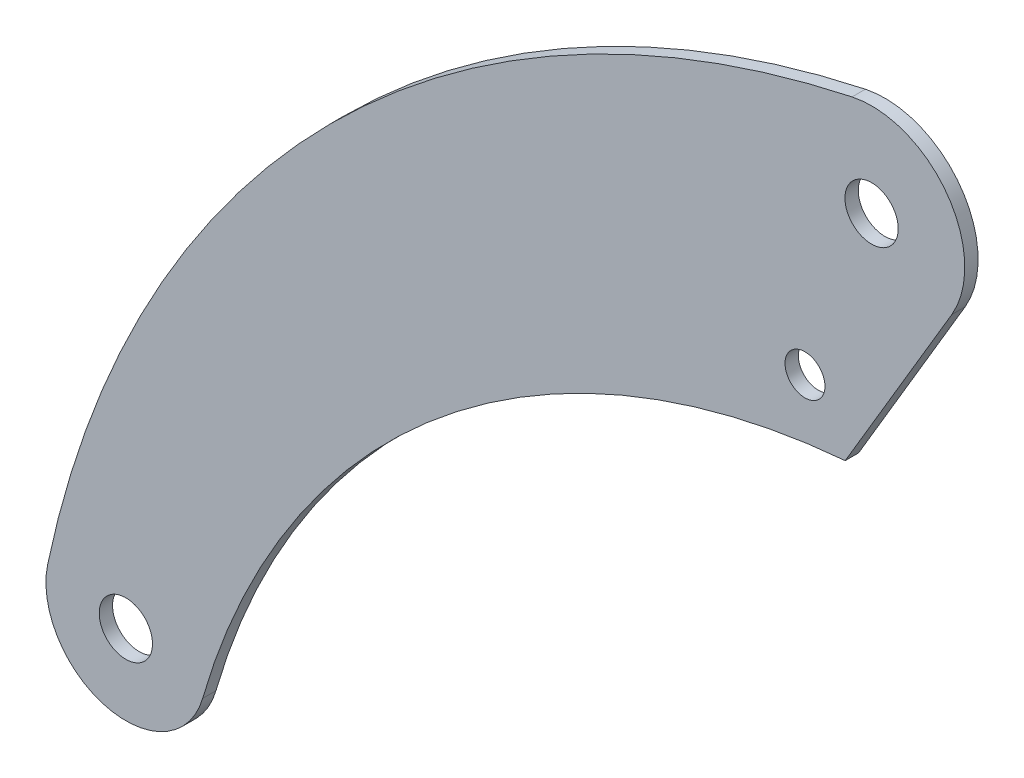
ISO-10303-21;
HEADER;
FILE_DESCRIPTION(('STEP AP214'),'2;1');
FILE_NAME('part.step','',(''),(''),'','','');
FILE_SCHEMA(('AUTOMOTIVE_DESIGN { 1 0 10303 214 1 1 1 1 }'));
ENDSEC;
DATA;
#1=APPLICATION_CONTEXT('core data for automotive mechanical design processes');
#2=APPLICATION_PROTOCOL_DEFINITION('international standard','automotive_design',2000,#1);
#3=PRODUCT_CONTEXT('',#1,'mechanical');
#4=PRODUCT('Part','Part','',(#3));
#5=PRODUCT_RELATED_PRODUCT_CATEGORY('part','',(#4));
#6=PRODUCT_DEFINITION_FORMATION('','',#4);
#7=PRODUCT_DEFINITION_CONTEXT('part definition',#1,'design');
#8=PRODUCT_DEFINITION('design','',#6,#7);
#9=PRODUCT_DEFINITION_SHAPE('','',#8);
#10=(LENGTH_UNIT() NAMED_UNIT(*) SI_UNIT(.MILLI.,.METRE.));
#11=(NAMED_UNIT(*) PLANE_ANGLE_UNIT() SI_UNIT($,.RADIAN.));
#12=(NAMED_UNIT(*) SI_UNIT($,.STERADIAN.) SOLID_ANGLE_UNIT());
#13=UNCERTAINTY_MEASURE_WITH_UNIT(LENGTH_MEASURE(1.E-05),#10,'distance_accuracy_value','');
#14=(GEOMETRIC_REPRESENTATION_CONTEXT(3) GLOBAL_UNCERTAINTY_ASSIGNED_CONTEXT((#13)) GLOBAL_UNIT_ASSIGNED_CONTEXT((#10,
#11,#12)) REPRESENTATION_CONTEXT('',''));
#15=CARTESIAN_POINT('',(0.,0.,0.));
#16=DIRECTION('',(0.,0.,1.));
#17=DIRECTION('',(1.,0.,0.));
#18=AXIS2_PLACEMENT_3D('',#15,#16,#17);
#19=CARTESIAN_POINT('',(149.481823007681,-699.199674335093,5.));
#20=DIRECTION('',(0.,0.,-1.));
#21=DIRECTION('',(-1.,0.,0.));
#22=AXIS2_PLACEMENT_3D('',#19,#20,#21);
#23=PLANE('',#22);
#24=CARTESIAN_POINT('',(149.481823007681,-699.199674335093,5.));
#25=DIRECTION('',(0.,0.,1.));
#26=DIRECTION('',(-1.,0.,0.));
#27=AXIS2_PLACEMENT_3D('',#24,#25,#26);
#28=CIRCLE('',#27,785.);
#29=CARTESIAN_POINT('',(-14.6345840706821,68.4531149698693,5.));
#30=VERTEX_POINT('',#29);
#31=CARTESIAN_POINT('',(-618.715737076498,-537.652440744682,5.));
#32=VERTEX_POINT('',#31);
#33=EDGE_CURVE('E133',#30,#32,#28,.T.);
#34=ORIENTED_EDGE('',*,*,#33,.T.);
#35=CARTESIAN_POINT('',(-560.,-550.,5.));
#36=DIRECTION('',(0.,0.,1.));
#37=DIRECTION('',(1.,0.,0.));
#38=AXIS2_PLACEMENT_3D('',#35,#36,#37);
#39=CIRCLE('',#38,60.);
#40=CARTESIAN_POINT('',(-502.341900982989,-566.599506551236,5.));
#41=VERTEX_POINT('',#40);
#42=EDGE_CURVE('E91',#32,#41,#39,.T.);
#43=ORIENTED_EDGE('',*,*,#42,.T.);
#44=CARTESIAN_POINT('',(26.1906733396146,-718.761649937565,5.));
#45=DIRECTION('',(0.,0.,-1.));
#46=DIRECTION('',(1.,0.,0.));
#47=AXIS2_PLACEMENT_3D('',#44,#45,#46);
#48=CIRCLE('',#47,550.);
#49=CARTESIAN_POINT('',(-19.7795926456078,-170.686167321121,5.));
#50=VERTEX_POINT('',#49);
#51=EDGE_CURVE('E95',#41,#50,#48,.T.);
#52=ORIENTED_EDGE('',*,*,#51,.T.);
#53=DIRECTION('',(0.509802390301733,0.860291533634175,0.));
#54=VECTOR('',#53,1.);
#55=CARTESIAN_POINT('',(60.2204073543922,-35.6861673211213,5.));
#56=LINE('',#55,#54);
#57=CARTESIAN_POINT('',(60.2204073543922,-35.6861673211213,5.));
#58=VERTEX_POINT('',#57);
#59=EDGE_CURVE('E99',#50,#58,#56,.T.);
#60=ORIENTED_EDGE('',*,*,#59,.T.);
#61=CARTESIAN_POINT('',(0.,0.,5.));
#62=DIRECTION('',(0.,0.,1.));
#63=DIRECTION('',(-1.,0.,0.));
#64=AXIS2_PLACEMENT_3D('',#61,#62,#63);
#65=CIRCLE('',#64,70.0000000000001);
#66=EDGE_CURVE('E57',#58,#30,#65,.T.);
#67=ORIENTED_EDGE('',*,*,#66,.T.);
#68=EDGE_LOOP('',(#34,#43,#52,#60,#67));
#69=FACE_BOUND('',#68,.T.);
#70=CARTESIAN_POINT('',(0.,0.,5.));
#71=DIRECTION('',(0.,0.,1.));
#72=DIRECTION('',(1.,0.,0.));
#73=AXIS2_PLACEMENT_3D('',#70,#71,#72);
#74=CIRCLE('',#73,20.);
#75=CARTESIAN_POINT('',(20.,0.,5.));
#76=VERTEX_POINT('',#75);
#77=EDGE_CURVE('E124',#76,#76,#74,.T.);
#78=ORIENTED_EDGE('',*,*,#77,.F.);
#79=EDGE_LOOP('',(#78));
#80=FACE_BOUND('',#79,.T.);
#81=CARTESIAN_POINT('',(-50.,-130.,5.));
#82=DIRECTION('',(0.,0.,1.));
#83=DIRECTION('',(1.,0.,0.));
#84=AXIS2_PLACEMENT_3D('',#81,#82,#83);
#85=CIRCLE('',#84,15.);
#86=CARTESIAN_POINT('',(-35.,-130.,5.));
#87=VERTEX_POINT('',#86);
#88=EDGE_CURVE('E187',#87,#87,#85,.T.);
#89=ORIENTED_EDGE('',*,*,#88,.F.);
#90=EDGE_LOOP('',(#89));
#91=FACE_BOUND('',#90,.T.);
#92=CARTESIAN_POINT('',(-560.,-550.,5.));
#93=DIRECTION('',(0.,0.,1.));
#94=DIRECTION('',(1.,0.,0.));
#95=AXIS2_PLACEMENT_3D('',#92,#93,#94);
#96=CIRCLE('',#95,20.0000000000001);
#97=CARTESIAN_POINT('',(-540.,-550.,5.));
#98=VERTEX_POINT('',#97);
#99=EDGE_CURVE('E176',#98,#98,#96,.T.);
#100=ORIENTED_EDGE('',*,*,#99,.F.);
#101=EDGE_LOOP('',(#100));
#102=FACE_BOUND('',#101,.T.);
#103=ADVANCED_FACE('F39',(#69,#80,#91,#102),#23,.F.);
#104=CARTESIAN_POINT('',(149.481823007681,-699.199674335093,-5.));
#105=DIRECTION('',(0.,0.,-1.));
#106=DIRECTION('',(-1.,0.,0.));
#107=AXIS2_PLACEMENT_3D('',#104,#105,#106);
#108=PLANE('',#107);
#109=CARTESIAN_POINT('',(-50.,-130.,-5.));
#110=DIRECTION('',(0.,0.,1.));
#111=DIRECTION('',(1.,0.,0.));
#112=AXIS2_PLACEMENT_3D('',#109,#110,#111);
#113=CIRCLE('',#112,15.);
#114=CARTESIAN_POINT('',(-35.,-130.,-5.));
#115=VERTEX_POINT('',#114);
#116=EDGE_CURVE('E184',#115,#115,#113,.T.);
#117=ORIENTED_EDGE('',*,*,#116,.T.);
#118=EDGE_LOOP('',(#117));
#119=FACE_BOUND('',#118,.T.);
#120=CARTESIAN_POINT('',(149.481823007681,-699.199674335093,-5.));
#121=DIRECTION('',(0.,0.,1.));
#122=DIRECTION('',(-1.,0.,0.));
#123=AXIS2_PLACEMENT_3D('',#120,#121,#122);
#124=CIRCLE('',#123,785.);
#125=CARTESIAN_POINT('',(-14.6345840706821,68.4531149698693,-5.));
#126=VERTEX_POINT('',#125);
#127=CARTESIAN_POINT('',(-618.715737076498,-537.652440744682,-5.));
#128=VERTEX_POINT('',#127);
#129=EDGE_CURVE('E119',#126,#128,#124,.T.);
#130=ORIENTED_EDGE('',*,*,#129,.F.);
#131=CARTESIAN_POINT('',(0.,0.,-5.));
#132=DIRECTION('',(0.,0.,1.));
#133=DIRECTION('',(-1.,0.,0.));
#134=AXIS2_PLACEMENT_3D('',#131,#132,#133);
#135=CIRCLE('',#134,70.0000000000001);
#136=CARTESIAN_POINT('',(60.2204073543922,-35.6861673211213,-5.));
#137=VERTEX_POINT('',#136);
#138=EDGE_CURVE('E83',#137,#126,#135,.T.);
#139=ORIENTED_EDGE('',*,*,#138,.F.);
#140=DIRECTION('',(0.509802390301733,0.860291533634175,0.));
#141=VECTOR('',#140,1.);
#142=CARTESIAN_POINT('',(60.2204073543922,-35.6861673211213,-5.));
#143=LINE('',#142,#141);
#144=CARTESIAN_POINT('',(-19.7795926456078,-170.686167321121,-5.));
#145=VERTEX_POINT('',#144);
#146=EDGE_CURVE('E77',#145,#137,#143,.T.);
#147=ORIENTED_EDGE('',*,*,#146,.F.);
#148=CARTESIAN_POINT('',(26.1906733396146,-718.761649937565,-5.));
#149=DIRECTION('',(0.,0.,-1.));
#150=DIRECTION('',(1.,0.,0.));
#151=AXIS2_PLACEMENT_3D('',#148,#149,#150);
#152=CIRCLE('',#151,550.);
#153=CARTESIAN_POINT('',(-502.341900982989,-566.599506551236,-5.));
#154=VERTEX_POINT('',#153);
#155=EDGE_CURVE('E107',#154,#145,#152,.T.);
#156=ORIENTED_EDGE('',*,*,#155,.F.);
#157=CARTESIAN_POINT('',(-560.,-550.,-5.));
#158=DIRECTION('',(0.,0.,1.));
#159=DIRECTION('',(1.,0.,0.));
#160=AXIS2_PLACEMENT_3D('',#157,#158,#159);
#161=CIRCLE('',#160,60.);
#162=EDGE_CURVE('E123',#128,#154,#161,.T.);
#163=ORIENTED_EDGE('',*,*,#162,.F.);
#164=EDGE_LOOP('',(#130,#139,#147,#156,#163));
#165=FACE_BOUND('',#164,.T.);
#166=CARTESIAN_POINT('',(0.,0.,-5.));
#167=DIRECTION('',(0.,0.,1.));
#168=DIRECTION('',(1.,0.,0.));
#169=AXIS2_PLACEMENT_3D('',#166,#167,#168);
#170=CIRCLE('',#169,20.);
#171=CARTESIAN_POINT('',(20.,0.,-5.));
#172=VERTEX_POINT('',#171);
#173=EDGE_CURVE('E191',#172,#172,#170,.T.);
#174=ORIENTED_EDGE('',*,*,#173,.T.);
#175=EDGE_LOOP('',(#174));
#176=FACE_BOUND('',#175,.T.);
#177=CARTESIAN_POINT('',(-560.,-550.,-5.));
#178=DIRECTION('',(0.,0.,1.));
#179=DIRECTION('',(1.,0.,0.));
#180=AXIS2_PLACEMENT_3D('',#177,#178,#179);
#181=CIRCLE('',#180,20.0000000000001);
#182=CARTESIAN_POINT('',(-540.,-550.,-5.));
#183=VERTEX_POINT('',#182);
#184=EDGE_CURVE('E179',#183,#183,#181,.T.);
#185=ORIENTED_EDGE('',*,*,#184,.T.);
#186=EDGE_LOOP('',(#185));
#187=FACE_BOUND('',#186,.T.);
#188=ADVANCED_FACE('F140',(#119,#165,#176,#187),#108,.T.);
#189=CARTESIAN_POINT('',(149.481823007681,-699.199674335093,5.));
#190=DIRECTION('',(0.,0.,-1.));
#191=DIRECTION('',(-1.,0.,0.));
#192=AXIS2_PLACEMENT_3D('',#189,#190,#191);
#193=CYLINDRICAL_SURFACE('',#192,785.);
#194=ORIENTED_EDGE('',*,*,#129,.T.);
#195=DIRECTION('',(0.,0.,-1.));
#196=VECTOR('',#195,1.);
#197=CARTESIAN_POINT('',(-618.715737076498,-537.652440744682,5.));
#198=LINE('',#197,#196);
#199=EDGE_CURVE('E11',#32,#128,#198,.T.);
#200=ORIENTED_EDGE('',*,*,#199,.F.);
#201=ORIENTED_EDGE('',*,*,#33,.F.);
#202=DIRECTION('',(0.,0.,-1.));
#203=VECTOR('',#202,1.);
#204=CARTESIAN_POINT('',(-14.6345840706821,68.4531149698693,5.));
#205=LINE('',#204,#203);
#206=EDGE_CURVE('E115',#30,#126,#205,.T.);
#207=ORIENTED_EDGE('',*,*,#206,.T.);
#208=EDGE_LOOP('',(#194,#200,#201,#207));
#209=FACE_BOUND('',#208,.T.);
#210=ADVANCED_FACE('F41',(#209),#193,.T.);
#211=CARTESIAN_POINT('',(-560.,-550.,5.));
#212=DIRECTION('',(0.,0.,-1.));
#213=DIRECTION('',(-1.,0.,0.));
#214=AXIS2_PLACEMENT_3D('',#211,#212,#213);
#215=CYLINDRICAL_SURFACE('',#214,60.);
#216=ORIENTED_EDGE('',*,*,#162,.T.);
#217=DIRECTION('',(0.,0.,-1.));
#218=VECTOR('',#217,1.);
#219=CARTESIAN_POINT('',(-502.341900982989,-566.599506551236,5.));
#220=LINE('',#219,#218);
#221=EDGE_CURVE('E49',#41,#154,#220,.T.);
#222=ORIENTED_EDGE('',*,*,#221,.F.);
#223=ORIENTED_EDGE('',*,*,#42,.F.);
#224=ORIENTED_EDGE('',*,*,#199,.T.);
#225=EDGE_LOOP('',(#216,#222,#223,#224));
#226=FACE_BOUND('',#225,.T.);
#227=ADVANCED_FACE('F238',(#226),#215,.T.);
#228=CARTESIAN_POINT('',(26.1906733396146,-718.761649937565,5.));
#229=DIRECTION('',(0.,0.,-1.));
#230=DIRECTION('',(-1.,0.,0.));
#231=AXIS2_PLACEMENT_3D('',#228,#229,#230);
#232=CYLINDRICAL_SURFACE('',#231,550.);
#233=ORIENTED_EDGE('',*,*,#155,.T.);
#234=DIRECTION('',(0.,0.,-1.));
#235=VECTOR('',#234,1.);
#236=CARTESIAN_POINT('',(-19.7795926456078,-170.686167321121,5.));
#237=LINE('',#236,#235);
#238=EDGE_CURVE('E104',#50,#145,#237,.T.);
#239=ORIENTED_EDGE('',*,*,#238,.F.);
#240=ORIENTED_EDGE('',*,*,#51,.F.);
#241=ORIENTED_EDGE('',*,*,#221,.T.);
#242=EDGE_LOOP('',(#233,#239,#240,#241));
#243=FACE_BOUND('',#242,.T.);
#244=ADVANCED_FACE('F105',(#243),#232,.F.);
#245=CARTESIAN_POINT('',(60.2204073543922,-35.6861673211213,5.));
#246=DIRECTION('',(-0.860291533634174,0.509802390301733,0.));
#247=DIRECTION('',(-0.509802390301733,-0.860291533634174,0.));
#248=AXIS2_PLACEMENT_3D('',#245,#246,#247);
#249=PLANE('',#248);
#250=ORIENTED_EDGE('',*,*,#146,.T.);
#251=DIRECTION('',(0.,0.,-1.));
#252=VECTOR('',#251,1.);
#253=CARTESIAN_POINT('',(60.2204073543922,-35.6861673211213,5.));
#254=LINE('',#253,#252);
#255=EDGE_CURVE('E109',#58,#137,#254,.T.);
#256=ORIENTED_EDGE('',*,*,#255,.F.);
#257=ORIENTED_EDGE('',*,*,#59,.F.);
#258=ORIENTED_EDGE('',*,*,#238,.T.);
#259=EDGE_LOOP('',(#250,#256,#257,#258));
#260=FACE_BOUND('',#259,.T.);
#261=ADVANCED_FACE('F111',(#260),#249,.F.);
#262=CARTESIAN_POINT('',(0.,0.,5.));
#263=DIRECTION('',(0.,0.,-1.));
#264=DIRECTION('',(-1.,0.,0.));
#265=AXIS2_PLACEMENT_3D('',#262,#263,#264);
#266=CYLINDRICAL_SURFACE('',#265,70.0000000000001);
#267=ORIENTED_EDGE('',*,*,#138,.T.);
#268=ORIENTED_EDGE('',*,*,#206,.F.);
#269=ORIENTED_EDGE('',*,*,#66,.F.);
#270=ORIENTED_EDGE('',*,*,#255,.T.);
#271=EDGE_LOOP('',(#267,#268,#269,#270));
#272=FACE_BOUND('',#271,.T.);
#273=ADVANCED_FACE('F145',(#272),#266,.T.);
#274=CARTESIAN_POINT('',(0.,0.,5.));
#275=DIRECTION('',(0.,0.,-1.));
#276=DIRECTION('',(-1.,0.,0.));
#277=AXIS2_PLACEMENT_3D('',#274,#275,#276);
#278=CYLINDRICAL_SURFACE('',#277,20.);
#279=ORIENTED_EDGE('',*,*,#77,.T.);
#280=EDGE_LOOP('',(#279));
#281=FACE_BOUND('',#280,.T.);
#282=ORIENTED_EDGE('',*,*,#173,.F.);
#283=EDGE_LOOP('',(#282));
#284=FACE_BOUND('',#283,.T.);
#285=ADVANCED_FACE('F147',(#281,#284),#278,.F.);
#286=CARTESIAN_POINT('',(-50.,-130.,5.));
#287=DIRECTION('',(0.,0.,-1.));
#288=DIRECTION('',(-1.,0.,0.));
#289=AXIS2_PLACEMENT_3D('',#286,#287,#288);
#290=CYLINDRICAL_SURFACE('',#289,15.);
#291=ORIENTED_EDGE('',*,*,#88,.T.);
#292=EDGE_LOOP('',(#291));
#293=FACE_BOUND('',#292,.T.);
#294=ORIENTED_EDGE('',*,*,#116,.F.);
#295=EDGE_LOOP('',(#294));
#296=FACE_BOUND('',#295,.T.);
#297=ADVANCED_FACE('F153',(#293,#296),#290,.F.);
#298=CARTESIAN_POINT('',(-560.,-550.,5.));
#299=DIRECTION('',(0.,0.,-1.));
#300=DIRECTION('',(-1.,0.,0.));
#301=AXIS2_PLACEMENT_3D('',#298,#299,#300);
#302=CYLINDRICAL_SURFACE('',#301,20.0000000000001);
#303=ORIENTED_EDGE('',*,*,#99,.T.);
#304=EDGE_LOOP('',(#303));
#305=FACE_BOUND('',#304,.T.);
#306=ORIENTED_EDGE('',*,*,#184,.F.);
#307=EDGE_LOOP('',(#306));
#308=FACE_BOUND('',#307,.T.);
#309=ADVANCED_FACE('F167',(#305,#308),#302,.F.);
#310=CLOSED_SHELL('',(#103,#188,#210,#227,#244,#261,#273,#285,#297,#309));
#311=MANIFOLD_SOLID_BREP('B2',#310);
#312=ADVANCED_BREP_SHAPE_REPRESENTATION('',(#18,#311),#14);
#313=SHAPE_DEFINITION_REPRESENTATION(#9,#312);
ENDSEC;
END-ISO-10303-21;
